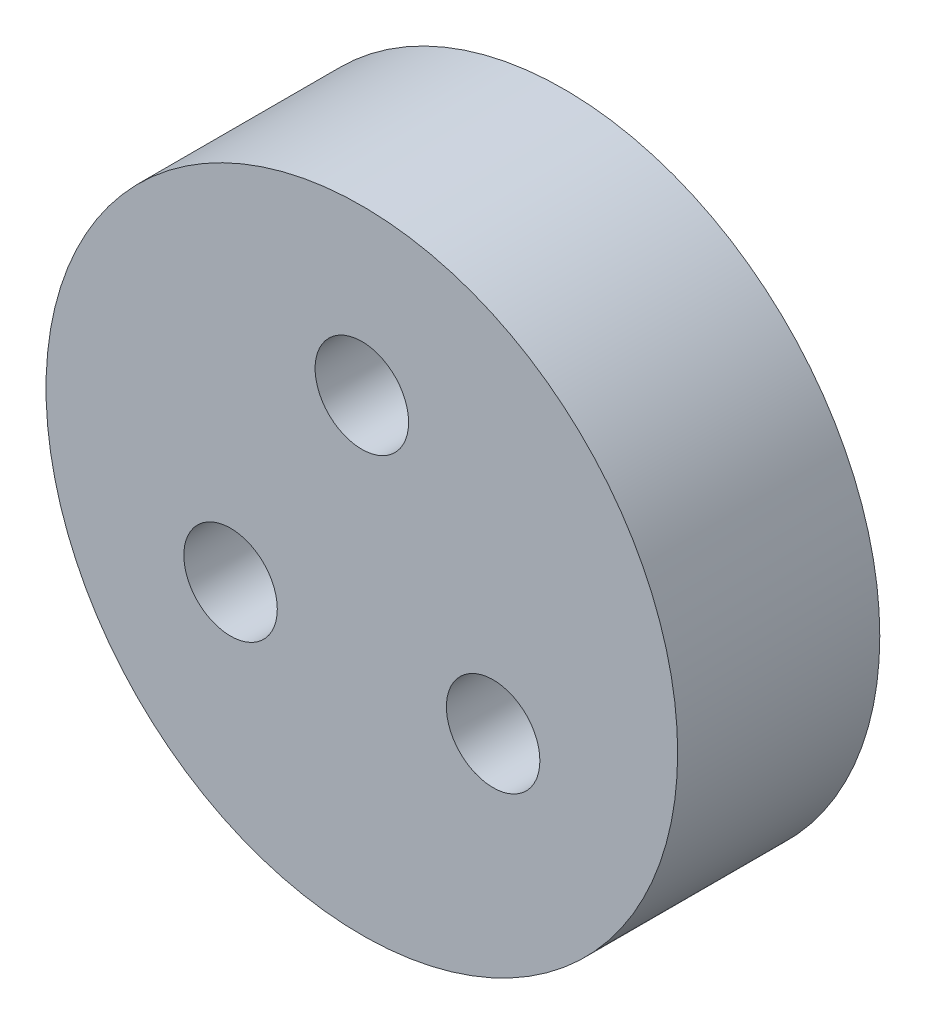
ISO-10303-21;
HEADER;
FILE_DESCRIPTION(('STEP AP214'),'2;1');
FILE_NAME('part.step','',(''),(''),'','','');
FILE_SCHEMA(('AUTOMOTIVE_DESIGN { 1 0 10303 214 1 1 1 1 }'));
ENDSEC;
DATA;
#1=APPLICATION_CONTEXT('core data for automotive mechanical design processes');
#2=APPLICATION_PROTOCOL_DEFINITION('international standard','automotive_design',2000,#1);
#3=PRODUCT_CONTEXT('',#1,'mechanical');
#4=PRODUCT('Part','Part','',(#3));
#5=PRODUCT_RELATED_PRODUCT_CATEGORY('part','',(#4));
#6=PRODUCT_DEFINITION_FORMATION('','',#4);
#7=PRODUCT_DEFINITION_CONTEXT('part definition',#1,'design');
#8=PRODUCT_DEFINITION('design','',#6,#7);
#9=PRODUCT_DEFINITION_SHAPE('','',#8);
#10=(LENGTH_UNIT() NAMED_UNIT(*) SI_UNIT(.MILLI.,.METRE.));
#11=(NAMED_UNIT(*) PLANE_ANGLE_UNIT() SI_UNIT($,.RADIAN.));
#12=(NAMED_UNIT(*) SI_UNIT($,.STERADIAN.) SOLID_ANGLE_UNIT());
#13=UNCERTAINTY_MEASURE_WITH_UNIT(LENGTH_MEASURE(1.E-05),#10,'distance_accuracy_value','');
#14=(GEOMETRIC_REPRESENTATION_CONTEXT(3) GLOBAL_UNCERTAINTY_ASSIGNED_CONTEXT((#13)) GLOBAL_UNIT_ASSIGNED_CONTEXT((#10,
#11,#12)) REPRESENTATION_CONTEXT('',''));
#15=CARTESIAN_POINT('',(0.,0.,0.));
#16=DIRECTION('',(0.,0.,1.));
#17=DIRECTION('',(1.,0.,0.));
#18=AXIS2_PLACEMENT_3D('',#15,#16,#17);
#19=CARTESIAN_POINT('',(-5.19615242270666,-2.99999999999995,-0.000999999999999265));
#20=DIRECTION('',(0.,0.,1.));
#21=DIRECTION('',(1.,0.,0.));
#22=AXIS2_PLACEMENT_3D('',#19,#20,#21);
#23=CYLINDRICAL_SURFACE('',#22,1.85);
#24=CARTESIAN_POINT('',(-5.19615242270666,-2.99999999999995,8.));
#25=DIRECTION('',(0.,0.,1.));
#26=DIRECTION('',(-0.499999999999992,0.866025403784443,0.));
#27=AXIS2_PLACEMENT_3D('',#24,#25,#26);
#28=CIRCLE('',#27,1.85);
#29=CARTESIAN_POINT('',(-6.12115242270664,-1.39785300299873,8.));
#30=VERTEX_POINT('',#29);
#31=EDGE_CURVE('E320',#30,#30,#28,.T.);
#32=ORIENTED_EDGE('',*,*,#31,.T.);
#33=EDGE_LOOP('',(#32));
#34=FACE_BOUND('',#33,.T.);
#35=CARTESIAN_POINT('',(-5.19615242270666,-2.99999999999995,5.));
#36=DIRECTION('',(0.,0.,-1.));
#37=DIRECTION('',(-1.,0.,0.));
#38=AXIS2_PLACEMENT_3D('',#35,#36,#37);
#39=CIRCLE('',#38,1.85);
#40=CARTESIAN_POINT('',(-7.04615242270666,-2.99999999999995,5.));
#41=VERTEX_POINT('',#40);
#42=EDGE_CURVE('E51',#41,#41,#39,.F.);
#43=ORIENTED_EDGE('',*,*,#42,.F.);
#44=EDGE_LOOP('',(#43));
#45=FACE_BOUND('',#44,.T.);
#46=ADVANCED_FACE('F47',(#34,#45),#23,.F.);
#47=CARTESIAN_POINT('',(5.19615242270662,-3.00000000000002,-0.000999999999999265));
#48=DIRECTION('',(0.,0.,1.));
#49=DIRECTION('',(1.,0.,0.));
#50=AXIS2_PLACEMENT_3D('',#47,#48,#49);
#51=CYLINDRICAL_SURFACE('',#50,1.85);
#52=CARTESIAN_POINT('',(5.19615242270662,-3.00000000000002,8.));
#53=DIRECTION('',(0.,0.,1.));
#54=DIRECTION('',(-0.500000000000004,-0.866025403784436,0.));
#55=AXIS2_PLACEMENT_3D('',#52,#53,#54);
#56=CIRCLE('',#55,1.85);
#57=CARTESIAN_POINT('',(4.27115242270661,-4.60214699700123,8.));
#58=VERTEX_POINT('',#57);
#59=EDGE_CURVE('E315',#58,#58,#56,.T.);
#60=ORIENTED_EDGE('',*,*,#59,.T.);
#61=EDGE_LOOP('',(#60));
#62=FACE_BOUND('',#61,.T.);
#63=CARTESIAN_POINT('',(5.19615242270662,-3.00000000000002,5.));
#64=DIRECTION('',(0.,0.,-1.));
#65=DIRECTION('',(-1.,0.,0.));
#66=AXIS2_PLACEMENT_3D('',#63,#64,#65);
#67=CIRCLE('',#66,1.85);
#68=CARTESIAN_POINT('',(3.34615242270662,-3.00000000000002,5.));
#69=VERTEX_POINT('',#68);
#70=EDGE_CURVE('E240',#69,#69,#67,.F.);
#71=ORIENTED_EDGE('',*,*,#70,.F.);
#72=EDGE_LOOP('',(#71));
#73=FACE_BOUND('',#72,.T.);
#74=ADVANCED_FACE('F407',(#62,#73),#51,.F.);
#75=CARTESIAN_POINT('',(0.,6.,-0.000999999999999265));
#76=DIRECTION('',(0.,0.,1.));
#77=DIRECTION('',(1.,0.,0.));
#78=AXIS2_PLACEMENT_3D('',#75,#76,#77);
#79=CYLINDRICAL_SURFACE('',#78,1.85);
#80=CARTESIAN_POINT('',(0.,6.,8.));
#81=DIRECTION('',(0.,0.,1.));
#82=DIRECTION('',(1.,0.,0.));
#83=AXIS2_PLACEMENT_3D('',#80,#81,#82);
#84=CIRCLE('',#83,1.85);
#85=CARTESIAN_POINT('',(1.85,6.,8.));
#86=VERTEX_POINT('',#85);
#87=EDGE_CURVE('E389',#86,#86,#84,.T.);
#88=ORIENTED_EDGE('',*,*,#87,.T.);
#89=EDGE_LOOP('',(#88));
#90=FACE_BOUND('',#89,.T.);
#91=CARTESIAN_POINT('',(0.,6.,5.));
#92=DIRECTION('',(0.,0.,-1.));
#93=DIRECTION('',(-1.,0.,0.));
#94=AXIS2_PLACEMENT_3D('',#91,#92,#93);
#95=CIRCLE('',#94,1.85);
#96=CARTESIAN_POINT('',(-1.85,6.,5.));
#97=VERTEX_POINT('',#96);
#98=EDGE_CURVE('E373',#97,#97,#95,.F.);
#99=ORIENTED_EDGE('',*,*,#98,.F.);
#100=EDGE_LOOP('',(#99));
#101=FACE_BOUND('',#100,.T.);
#102=ADVANCED_FACE('F413',(#90,#101),#79,.F.);
#103=CARTESIAN_POINT('',(0.,0.,8.));
#104=DIRECTION('',(0.,0.,-1.));
#105=DIRECTION('',(-1.,0.,0.));
#106=AXIS2_PLACEMENT_3D('',#103,#104,#105);
#107=CYLINDRICAL_SURFACE('',#106,12.5);
#108=CARTESIAN_POINT('',(0.,0.,8.));
#109=DIRECTION('',(0.,0.,1.));
#110=DIRECTION('',(1.,0.,0.));
#111=AXIS2_PLACEMENT_3D('',#108,#109,#110);
#112=CIRCLE('',#111,12.5);
#113=CARTESIAN_POINT('',(12.5,0.,8.));
#114=VERTEX_POINT('',#113);
#115=EDGE_CURVE('E11',#114,#114,#112,.T.);
#116=ORIENTED_EDGE('',*,*,#115,.F.);
#117=EDGE_LOOP('',(#116));
#118=FACE_BOUND('',#117,.T.);
#119=CARTESIAN_POINT('',(0.,0.,0.));
#120=DIRECTION('',(0.,0.,1.));
#121=DIRECTION('',(1.,0.,0.));
#122=AXIS2_PLACEMENT_3D('',#119,#120,#121);
#123=CIRCLE('',#122,12.5);
#124=CARTESIAN_POINT('',(12.5,0.,0.));
#125=VERTEX_POINT('',#124);
#126=EDGE_CURVE('E57',#125,#125,#123,.T.);
#127=ORIENTED_EDGE('',*,*,#126,.T.);
#128=EDGE_LOOP('',(#127));
#129=FACE_BOUND('',#128,.T.);
#130=ADVANCED_FACE('F49',(#118,#129),#107,.T.);
#131=CARTESIAN_POINT('',(0.,0.,8.));
#132=DIRECTION('',(0.,0.,1.));
#133=DIRECTION('',(1.,0.,0.));
#134=AXIS2_PLACEMENT_3D('',#131,#132,#133);
#135=PLANE('',#134);
#136=ORIENTED_EDGE('',*,*,#59,.F.);
#137=EDGE_LOOP('',(#136));
#138=FACE_BOUND('',#137,.T.);
#139=ORIENTED_EDGE('',*,*,#31,.F.);
#140=EDGE_LOOP('',(#139));
#141=FACE_BOUND('',#140,.T.);
#142=ORIENTED_EDGE('',*,*,#87,.F.);
#143=EDGE_LOOP('',(#142));
#144=FACE_BOUND('',#143,.T.);
#145=ORIENTED_EDGE('',*,*,#115,.T.);
#146=EDGE_LOOP('',(#145));
#147=FACE_BOUND('',#146,.T.);
#148=ADVANCED_FACE('F450',(#138,#141,#144,#147),#135,.T.);
#149=CARTESIAN_POINT('',(0.,0.,0.));
#150=DIRECTION('',(0.,0.,1.));
#151=DIRECTION('',(1.,0.,0.));
#152=AXIS2_PLACEMENT_3D('',#149,#150,#151);
#153=PLANE('',#152);
#154=DIRECTION('',(0.499999999999996,-0.866025403784441,0.));
#155=VECTOR('',#154,1.);
#156=CARTESIAN_POINT('',(6.81273317643758,-0.200000000000031,0.));
#157=LINE('',#156,#155);
#158=CARTESIAN_POINT('',(6.81273317643758,-0.200000000000031,0.));
#159=VERTEX_POINT('',#158);
#160=CARTESIAN_POINT('',(8.42931393016853,-3.00000000000004,0.));
#161=VERTEX_POINT('',#160);
#162=EDGE_CURVE('E222',#159,#161,#157,.T.);
#163=ORIENTED_EDGE('',*,*,#162,.F.);
#164=DIRECTION('',(1.,0.,0.));
#165=VECTOR('',#164,1.);
#166=CARTESIAN_POINT('',(3.57957166897568,-0.200000000000015,0.));
#167=LINE('',#166,#165);
#168=CARTESIAN_POINT('',(3.57957166897568,-0.200000000000015,0.));
#169=VERTEX_POINT('',#168);
#170=EDGE_CURVE('E65',#169,#159,#167,.T.);
#171=ORIENTED_EDGE('',*,*,#170,.F.);
#172=DIRECTION('',(0.500000000000004,0.866025403784437,0.));
#173=VECTOR('',#172,1.);
#174=CARTESIAN_POINT('',(1.96299091524471,-3.00000000000001,0.));
#175=LINE('',#174,#173);
#176=CARTESIAN_POINT('',(1.96299091524471,-3.00000000000001,0.));
#177=VERTEX_POINT('',#176);
#178=EDGE_CURVE('E200',#177,#169,#175,.T.);
#179=ORIENTED_EDGE('',*,*,#178,.F.);
#180=DIRECTION('',(-0.499999999999996,0.866025403784441,0.));
#181=VECTOR('',#180,1.);
#182=CARTESIAN_POINT('',(3.57957166897565,-5.80000000000002,0.));
#183=LINE('',#182,#181);
#184=CARTESIAN_POINT('',(3.57957166897565,-5.80000000000002,0.));
#185=VERTEX_POINT('',#184);
#186=EDGE_CURVE('E206',#185,#177,#183,.T.);
#187=ORIENTED_EDGE('',*,*,#186,.F.);
#188=DIRECTION('',(-1.,0.,0.));
#189=VECTOR('',#188,1.);
#190=CARTESIAN_POINT('',(6.81273317643756,-5.80000000000003,0.));
#191=LINE('',#190,#189);
#192=CARTESIAN_POINT('',(6.81273317643756,-5.80000000000003,0.));
#193=VERTEX_POINT('',#192);
#194=EDGE_CURVE('E230',#193,#185,#191,.T.);
#195=ORIENTED_EDGE('',*,*,#194,.F.);
#196=DIRECTION('',(-0.500000000000004,-0.866025403784436,0.));
#197=VECTOR('',#196,1.);
#198=CARTESIAN_POINT('',(8.42931393016853,-3.00000000000004,0.));
#199=LINE('',#198,#197);
#200=EDGE_CURVE('E226',#161,#193,#199,.T.);
#201=ORIENTED_EDGE('',*,*,#200,.F.);
#202=EDGE_LOOP('',(#163,#171,#179,#187,#195,#201));
#203=FACE_BOUND('',#202,.T.);
#204=DIRECTION('',(-1.,0.,0.));
#205=VECTOR('',#204,1.);
#206=CARTESIAN_POINT('',(-3.57957166897573,-5.79999999999997,0.));
#207=LINE('',#206,#205);
#208=CARTESIAN_POINT('',(-3.57957166897573,-5.79999999999997,0.));
#209=VERTEX_POINT('',#208);
#210=CARTESIAN_POINT('',(-6.81273317643764,-5.79999999999994,0.));
#211=VERTEX_POINT('',#210);
#212=EDGE_CURVE('E280',#209,#211,#207,.T.);
#213=ORIENTED_EDGE('',*,*,#212,.F.);
#214=DIRECTION('',(-0.500000000000008,-0.866025403784434,0.));
#215=VECTOR('',#214,1.);
#216=CARTESIAN_POINT('',(-1.96299091524475,-2.99999999999998,0.));
#217=LINE('',#216,#215);
#218=CARTESIAN_POINT('',(-1.96299091524475,-2.99999999999998,0.));
#219=VERTEX_POINT('',#218);
#220=EDGE_CURVE('E73',#219,#209,#217,.T.);
#221=ORIENTED_EDGE('',*,*,#220,.F.);
#222=DIRECTION('',(0.499999999999992,-0.866025403784443,0.));
#223=VECTOR('',#222,1.);
#224=CARTESIAN_POINT('',(-3.57957166897568,-0.199999999999965,0.));
#225=LINE('',#224,#223);
#226=CARTESIAN_POINT('',(-3.57957166897568,-0.199999999999965,0.));
#227=VERTEX_POINT('',#226);
#228=EDGE_CURVE('E257',#227,#219,#225,.T.);
#229=ORIENTED_EDGE('',*,*,#228,.F.);
#230=DIRECTION('',(1.,0.,0.));
#231=VECTOR('',#230,1.);
#232=CARTESIAN_POINT('',(-6.81273317643759,-0.199999999999935,0.));
#233=LINE('',#232,#231);
#234=CARTESIAN_POINT('',(-6.81273317643759,-0.199999999999935,0.));
#235=VERTEX_POINT('',#234);
#236=EDGE_CURVE('E292',#235,#227,#233,.T.);
#237=ORIENTED_EDGE('',*,*,#236,.F.);
#238=DIRECTION('',(0.500000000000008,0.866025403784434,0.));
#239=VECTOR('',#238,1.);
#240=CARTESIAN_POINT('',(-8.42931393016857,-2.99999999999992,0.));
#241=LINE('',#240,#239);
#242=CARTESIAN_POINT('',(-8.42931393016857,-2.99999999999992,0.));
#243=VERTEX_POINT('',#242);
#244=EDGE_CURVE('E288',#243,#235,#241,.T.);
#245=ORIENTED_EDGE('',*,*,#244,.F.);
#246=DIRECTION('',(-0.499999999999992,0.866025403784443,0.));
#247=VECTOR('',#246,1.);
#248=CARTESIAN_POINT('',(-6.81273317643764,-5.79999999999994,0.));
#249=LINE('',#248,#247);
#250=EDGE_CURVE('E284',#211,#243,#249,.T.);
#251=ORIENTED_EDGE('',*,*,#250,.F.);
#252=EDGE_LOOP('',(#213,#221,#229,#237,#245,#251));
#253=FACE_BOUND('',#252,.T.);
#254=DIRECTION('',(0.5,0.866025403784439,0.));
#255=VECTOR('',#254,1.);
#256=CARTESIAN_POINT('',(-3.2331615074619,6.,0.));
#257=LINE('',#256,#255);
#258=CARTESIAN_POINT('',(-3.2331615074619,6.,0.));
#259=VERTEX_POINT('',#258);
#260=CARTESIAN_POINT('',(-1.61658075373095,8.8,0.));
#261=VERTEX_POINT('',#260);
#262=EDGE_CURVE('E352',#259,#261,#257,.T.);
#263=ORIENTED_EDGE('',*,*,#262,.F.);
#264=DIRECTION('',(-0.5,0.866025403784439,0.));
#265=VECTOR('',#264,1.);
#266=CARTESIAN_POINT('',(-1.61658075373095,3.2,0.));
#267=LINE('',#266,#265);
#268=CARTESIAN_POINT('',(-1.61658075373095,3.2,0.));
#269=VERTEX_POINT('',#268);
#270=EDGE_CURVE('E319',#269,#259,#267,.T.);
#271=ORIENTED_EDGE('',*,*,#270,.F.);
#272=DIRECTION('',(-1.,0.,0.));
#273=VECTOR('',#272,1.);
#274=CARTESIAN_POINT('',(1.61658075373095,3.2,0.));
#275=LINE('',#274,#273);
#276=CARTESIAN_POINT('',(1.61658075373095,3.2,0.));
#277=VERTEX_POINT('',#276);
#278=EDGE_CURVE('E329',#277,#269,#275,.T.);
#279=ORIENTED_EDGE('',*,*,#278,.F.);
#280=DIRECTION('',(-0.5,-0.866025403784439,0.));
#281=VECTOR('',#280,1.);
#282=CARTESIAN_POINT('',(3.23316150746191,6.,0.));
#283=LINE('',#282,#281);
#284=CARTESIAN_POINT('',(3.23316150746191,6.,0.));
#285=VERTEX_POINT('',#284);
#286=EDGE_CURVE('E364',#285,#277,#283,.T.);
#287=ORIENTED_EDGE('',*,*,#286,.F.);
#288=DIRECTION('',(0.5,-0.866025403784438,0.));
#289=VECTOR('',#288,1.);
#290=CARTESIAN_POINT('',(1.61658075373095,8.8,0.));
#291=LINE('',#290,#289);
#292=CARTESIAN_POINT('',(1.61658075373095,8.8,0.));
#293=VERTEX_POINT('',#292);
#294=EDGE_CURVE('E360',#293,#285,#291,.T.);
#295=ORIENTED_EDGE('',*,*,#294,.F.);
#296=DIRECTION('',(1.,0.,0.));
#297=VECTOR('',#296,1.);
#298=CARTESIAN_POINT('',(-1.61658075373095,8.8,0.));
#299=LINE('',#298,#297);
#300=EDGE_CURVE('E356',#261,#293,#299,.T.);
#301=ORIENTED_EDGE('',*,*,#300,.F.);
#302=EDGE_LOOP('',(#263,#271,#279,#287,#295,#301));
#303=FACE_BOUND('',#302,.T.);
#304=ORIENTED_EDGE('',*,*,#126,.F.);
#305=EDGE_LOOP('',(#304));
#306=FACE_BOUND('',#305,.T.);
#307=ADVANCED_FACE('F422',(#203,#253,#303,#306),#153,.F.);
#308=CARTESIAN_POINT('',(0.,0.,5.));
#309=DIRECTION('',(0.,0.,-1.));
#310=DIRECTION('',(-1.,0.,0.));
#311=AXIS2_PLACEMENT_3D('',#308,#309,#310);
#312=PLANE('',#311);
#313=DIRECTION('',(-0.5,0.866025403784439,0.));
#314=VECTOR('',#313,1.);
#315=CARTESIAN_POINT('',(-1.61658075373095,3.2,5.));
#316=LINE('',#315,#314);
#317=CARTESIAN_POINT('',(-1.61658075373095,3.2,5.));
#318=VERTEX_POINT('',#317);
#319=CARTESIAN_POINT('',(-3.2331615074619,6.,5.));
#320=VERTEX_POINT('',#319);
#321=EDGE_CURVE('E324',#318,#320,#316,.T.);
#322=ORIENTED_EDGE('',*,*,#321,.T.);
#323=DIRECTION('',(0.5,0.866025403784439,0.));
#324=VECTOR('',#323,1.);
#325=CARTESIAN_POINT('',(-3.2331615074619,6.,5.));
#326=LINE('',#325,#324);
#327=CARTESIAN_POINT('',(-1.61658075373095,8.8,5.));
#328=VERTEX_POINT('',#327);
#329=EDGE_CURVE('E328',#320,#328,#326,.T.);
#330=ORIENTED_EDGE('',*,*,#329,.T.);
#331=DIRECTION('',(1.,0.,0.));
#332=VECTOR('',#331,1.);
#333=CARTESIAN_POINT('',(-1.61658075373095,8.8,5.));
#334=LINE('',#333,#332);
#335=CARTESIAN_POINT('',(1.61658075373095,8.8,5.));
#336=VERTEX_POINT('',#335);
#337=EDGE_CURVE('E333',#328,#336,#334,.T.);
#338=ORIENTED_EDGE('',*,*,#337,.T.);
#339=DIRECTION('',(0.5,-0.866025403784438,0.));
#340=VECTOR('',#339,1.);
#341=CARTESIAN_POINT('',(1.61658075373095,8.8,5.));
#342=LINE('',#341,#340);
#343=CARTESIAN_POINT('',(3.23316150746191,6.,5.));
#344=VERTEX_POINT('',#343);
#345=EDGE_CURVE('E337',#336,#344,#342,.T.);
#346=ORIENTED_EDGE('',*,*,#345,.T.);
#347=DIRECTION('',(-0.5,-0.866025403784439,0.));
#348=VECTOR('',#347,1.);
#349=CARTESIAN_POINT('',(3.23316150746191,6.,5.));
#350=LINE('',#349,#348);
#351=CARTESIAN_POINT('',(1.61658075373095,3.2,5.));
#352=VERTEX_POINT('',#351);
#353=EDGE_CURVE('E341',#344,#352,#350,.T.);
#354=ORIENTED_EDGE('',*,*,#353,.T.);
#355=DIRECTION('',(-1.,0.,0.));
#356=VECTOR('',#355,1.);
#357=CARTESIAN_POINT('',(1.61658075373095,3.2,5.));
#358=LINE('',#357,#356);
#359=EDGE_CURVE('E345',#352,#318,#358,.T.);
#360=ORIENTED_EDGE('',*,*,#359,.T.);
#361=EDGE_LOOP('',(#322,#330,#338,#346,#354,#360));
#362=FACE_BOUND('',#361,.T.);
#363=ORIENTED_EDGE('',*,*,#98,.T.);
#364=EDGE_LOOP('',(#363));
#365=FACE_BOUND('',#364,.T.);
#366=ADVANCED_FACE('F418',(#362,#365),#312,.T.);
#367=CARTESIAN_POINT('',(-1.61658075373095,3.2,5.));
#368=DIRECTION('',(-0.866025403784439,-0.5,0.));
#369=DIRECTION('',(0.5,-0.866025403784439,0.));
#370=AXIS2_PLACEMENT_3D('',#367,#368,#369);
#371=PLANE('',#370);
#372=ORIENTED_EDGE('',*,*,#270,.T.);
#373=DIRECTION('',(0.,0.,-1.));
#374=VECTOR('',#373,1.);
#375=CARTESIAN_POINT('',(-3.2331615074619,6.,5.));
#376=LINE('',#375,#374);
#377=EDGE_CURVE('E349',#320,#259,#376,.T.);
#378=ORIENTED_EDGE('',*,*,#377,.F.);
#379=ORIENTED_EDGE('',*,*,#321,.F.);
#380=DIRECTION('',(0.,0.,-1.));
#381=VECTOR('',#380,1.);
#382=CARTESIAN_POINT('',(-1.61658075373095,3.2,5.));
#383=LINE('',#382,#381);
#384=EDGE_CURVE('E371',#318,#269,#383,.T.);
#385=ORIENTED_EDGE('',*,*,#384,.T.);
#386=EDGE_LOOP('',(#372,#378,#379,#385));
#387=FACE_BOUND('',#386,.T.);
#388=ADVANCED_FACE('F421',(#387),#371,.F.);
#389=CARTESIAN_POINT('',(1.61658075373095,3.2,5.));
#390=DIRECTION('',(0.,-1.,0.));
#391=DIRECTION('',(1.,0.,0.));
#392=AXIS2_PLACEMENT_3D('',#389,#390,#391);
#393=PLANE('',#392);
#394=ORIENTED_EDGE('',*,*,#278,.T.);
#395=ORIENTED_EDGE('',*,*,#384,.F.);
#396=ORIENTED_EDGE('',*,*,#359,.F.);
#397=DIRECTION('',(0.,0.,-1.));
#398=VECTOR('',#397,1.);
#399=CARTESIAN_POINT('',(1.61658075373095,3.2,5.));
#400=LINE('',#399,#398);
#401=EDGE_CURVE('E374',#352,#277,#400,.T.);
#402=ORIENTED_EDGE('',*,*,#401,.T.);
#403=EDGE_LOOP('',(#394,#395,#396,#402));
#404=FACE_BOUND('',#403,.T.);
#405=ADVANCED_FACE('F424',(#404),#393,.F.);
#406=CARTESIAN_POINT('',(3.23316150746191,6.,5.));
#407=DIRECTION('',(0.866025403784439,-0.5,0.));
#408=DIRECTION('',(0.5,0.866025403784439,0.));
#409=AXIS2_PLACEMENT_3D('',#406,#407,#408);
#410=PLANE('',#409);
#411=ORIENTED_EDGE('',*,*,#286,.T.);
#412=ORIENTED_EDGE('',*,*,#401,.F.);
#413=ORIENTED_EDGE('',*,*,#353,.F.);
#414=DIRECTION('',(0.,0.,-1.));
#415=VECTOR('',#414,1.);
#416=CARTESIAN_POINT('',(3.23316150746191,6.,5.));
#417=LINE('',#416,#415);
#418=EDGE_CURVE('E377',#344,#285,#417,.T.);
#419=ORIENTED_EDGE('',*,*,#418,.T.);
#420=EDGE_LOOP('',(#411,#412,#413,#419));
#421=FACE_BOUND('',#420,.T.);
#422=ADVANCED_FACE('F427',(#421),#410,.F.);
#423=CARTESIAN_POINT('',(1.61658075373095,8.8,5.));
#424=DIRECTION('',(0.866025403784439,0.5,0.));
#425=DIRECTION('',(-0.5,0.866025403784439,0.));
#426=AXIS2_PLACEMENT_3D('',#423,#424,#425);
#427=PLANE('',#426);
#428=ORIENTED_EDGE('',*,*,#294,.T.);
#429=ORIENTED_EDGE('',*,*,#418,.F.);
#430=ORIENTED_EDGE('',*,*,#345,.F.);
#431=DIRECTION('',(0.,0.,-1.));
#432=VECTOR('',#431,1.);
#433=CARTESIAN_POINT('',(1.61658075373095,8.8,5.));
#434=LINE('',#433,#432);
#435=EDGE_CURVE('E380',#336,#293,#434,.T.);
#436=ORIENTED_EDGE('',*,*,#435,.T.);
#437=EDGE_LOOP('',(#428,#429,#430,#436));
#438=FACE_BOUND('',#437,.T.);
#439=ADVANCED_FACE('F431',(#438),#427,.F.);
#440=CARTESIAN_POINT('',(-1.61658075373095,8.8,5.));
#441=DIRECTION('',(0.,1.,0.));
#442=DIRECTION('',(0.,0.,1.));
#443=AXIS2_PLACEMENT_3D('',#440,#441,#442);
#444=PLANE('',#443);
#445=ORIENTED_EDGE('',*,*,#300,.T.);
#446=ORIENTED_EDGE('',*,*,#435,.F.);
#447=ORIENTED_EDGE('',*,*,#337,.F.);
#448=DIRECTION('',(0.,0.,-1.));
#449=VECTOR('',#448,1.);
#450=CARTESIAN_POINT('',(-1.61658075373095,8.8,5.));
#451=LINE('',#450,#449);
#452=EDGE_CURVE('E383',#328,#261,#451,.T.);
#453=ORIENTED_EDGE('',*,*,#452,.T.);
#454=EDGE_LOOP('',(#445,#446,#447,#453));
#455=FACE_BOUND('',#454,.T.);
#456=ADVANCED_FACE('F435',(#455),#444,.F.);
#457=CARTESIAN_POINT('',(-3.2331615074619,6.,5.));
#458=DIRECTION('',(-0.866025403784439,0.5,0.));
#459=DIRECTION('',(-0.5,-0.866025403784439,0.));
#460=AXIS2_PLACEMENT_3D('',#457,#458,#459);
#461=PLANE('',#460);
#462=ORIENTED_EDGE('',*,*,#262,.T.);
#463=ORIENTED_EDGE('',*,*,#452,.F.);
#464=ORIENTED_EDGE('',*,*,#329,.F.);
#465=ORIENTED_EDGE('',*,*,#377,.T.);
#466=EDGE_LOOP('',(#462,#463,#464,#465));
#467=FACE_BOUND('',#466,.T.);
#468=ADVANCED_FACE('F439',(#467),#461,.F.);
#469=CARTESIAN_POINT('',(0.,0.,5.));
#470=DIRECTION('',(0.,0.,-1.));
#471=DIRECTION('',(0.500000000000004,0.866025403784436,0.));
#472=AXIS2_PLACEMENT_3D('',#469,#470,#471);
#473=PLANE('',#472);
#474=DIRECTION('',(1.,0.,0.));
#475=VECTOR('',#474,1.);
#476=CARTESIAN_POINT('',(3.57957166897568,-0.200000000000015,5.));
#477=LINE('',#476,#475);
#478=CARTESIAN_POINT('',(3.57957166897568,-0.200000000000015,5.));
#479=VERTEX_POINT('',#478);
#480=CARTESIAN_POINT('',(6.81273317643758,-0.200000000000031,5.));
#481=VERTEX_POINT('',#480);
#482=EDGE_CURVE('E177',#479,#481,#477,.T.);
#483=ORIENTED_EDGE('',*,*,#482,.T.);
#484=DIRECTION('',(0.499999999999996,-0.866025403784441,0.));
#485=VECTOR('',#484,1.);
#486=CARTESIAN_POINT('',(6.81273317643758,-0.200000000000031,5.));
#487=LINE('',#486,#485);
#488=CARTESIAN_POINT('',(8.42931393016853,-3.00000000000004,5.));
#489=VERTEX_POINT('',#488);
#490=EDGE_CURVE('E187',#481,#489,#487,.T.);
#491=ORIENTED_EDGE('',*,*,#490,.T.);
#492=DIRECTION('',(-0.500000000000004,-0.866025403784436,0.));
#493=VECTOR('',#492,1.);
#494=CARTESIAN_POINT('',(8.42931393016853,-3.00000000000004,5.));
#495=LINE('',#494,#493);
#496=CARTESIAN_POINT('',(6.81273317643756,-5.80000000000003,5.));
#497=VERTEX_POINT('',#496);
#498=EDGE_CURVE('E193',#489,#497,#495,.T.);
#499=ORIENTED_EDGE('',*,*,#498,.T.);
#500=DIRECTION('',(-1.,0.,0.));
#501=VECTOR('',#500,1.);
#502=CARTESIAN_POINT('',(6.81273317643756,-5.80000000000003,5.));
#503=LINE('',#502,#501);
#504=CARTESIAN_POINT('',(3.57957166897565,-5.80000000000002,5.));
#505=VERTEX_POINT('',#504);
#506=EDGE_CURVE('E211',#497,#505,#503,.T.);
#507=ORIENTED_EDGE('',*,*,#506,.T.);
#508=DIRECTION('',(-0.499999999999996,0.866025403784441,0.));
#509=VECTOR('',#508,1.);
#510=CARTESIAN_POINT('',(3.57957166897565,-5.80000000000002,5.));
#511=LINE('',#510,#509);
#512=CARTESIAN_POINT('',(1.96299091524471,-3.00000000000001,5.));
#513=VERTEX_POINT('',#512);
#514=EDGE_CURVE('E215',#505,#513,#511,.T.);
#515=ORIENTED_EDGE('',*,*,#514,.T.);
#516=DIRECTION('',(0.500000000000004,0.866025403784437,0.));
#517=VECTOR('',#516,1.);
#518=CARTESIAN_POINT('',(1.96299091524471,-3.00000000000001,5.));
#519=LINE('',#518,#517);
#520=EDGE_CURVE('E184',#513,#479,#519,.T.);
#521=ORIENTED_EDGE('',*,*,#520,.T.);
#522=EDGE_LOOP('',(#483,#491,#499,#507,#515,#521));
#523=FACE_BOUND('',#522,.T.);
#524=ORIENTED_EDGE('',*,*,#70,.T.);
#525=EDGE_LOOP('',(#524));
#526=FACE_BOUND('',#525,.T.);
#527=ADVANCED_FACE('F195',(#523,#526),#473,.T.);
#528=CARTESIAN_POINT('',(3.57957166897568,-0.200000000000015,5.));
#529=DIRECTION('',(0.,1.,0.));
#530=DIRECTION('',(-1.,0.,0.));
#531=AXIS2_PLACEMENT_3D('',#528,#529,#530);
#532=PLANE('',#531);
#533=ORIENTED_EDGE('',*,*,#170,.T.);
#534=DIRECTION('',(0.,0.,-1.));
#535=VECTOR('',#534,1.);
#536=CARTESIAN_POINT('',(6.81273317643758,-0.200000000000031,5.));
#537=LINE('',#536,#535);
#538=EDGE_CURVE('E173',#481,#159,#537,.T.);
#539=ORIENTED_EDGE('',*,*,#538,.F.);
#540=ORIENTED_EDGE('',*,*,#482,.F.);
#541=DIRECTION('',(0.,0.,-1.));
#542=VECTOR('',#541,1.);
#543=CARTESIAN_POINT('',(3.57957166897568,-0.200000000000015,5.));
#544=LINE('',#543,#542);
#545=EDGE_CURVE('E237',#479,#169,#544,.T.);
#546=ORIENTED_EDGE('',*,*,#545,.T.);
#547=EDGE_LOOP('',(#533,#539,#540,#546));
#548=FACE_BOUND('',#547,.T.);
#549=ADVANCED_FACE('F175',(#548),#532,.F.);
#550=CARTESIAN_POINT('',(1.96299091524471,-3.00000000000001,5.));
#551=DIRECTION('',(-0.866025403784436,0.500000000000004,0.));
#552=DIRECTION('',(-0.500000000000004,-0.866025403784436,0.));
#553=AXIS2_PLACEMENT_3D('',#550,#551,#552);
#554=PLANE('',#553);
#555=ORIENTED_EDGE('',*,*,#178,.T.);
#556=ORIENTED_EDGE('',*,*,#545,.F.);
#557=ORIENTED_EDGE('',*,*,#520,.F.);
#558=DIRECTION('',(0.,0.,-1.));
#559=VECTOR('',#558,1.);
#560=CARTESIAN_POINT('',(1.96299091524471,-3.00000000000001,5.));
#561=LINE('',#560,#559);
#562=EDGE_CURVE('E241',#513,#177,#561,.T.);
#563=ORIENTED_EDGE('',*,*,#562,.T.);
#564=EDGE_LOOP('',(#555,#556,#557,#563));
#565=FACE_BOUND('',#564,.T.);
#566=ADVANCED_FACE('F534',(#565),#554,.F.);
#567=CARTESIAN_POINT('',(3.57957166897565,-5.80000000000002,5.));
#568=DIRECTION('',(-0.866025403784441,-0.499999999999996,0.));
#569=DIRECTION('',(0.499999999999996,-0.866025403784441,0.));
#570=AXIS2_PLACEMENT_3D('',#567,#568,#569);
#571=PLANE('',#570);
#572=ORIENTED_EDGE('',*,*,#186,.T.);
#573=ORIENTED_EDGE('',*,*,#562,.F.);
#574=ORIENTED_EDGE('',*,*,#514,.F.);
#575=DIRECTION('',(0.,0.,-1.));
#576=VECTOR('',#575,1.);
#577=CARTESIAN_POINT('',(3.57957166897565,-5.80000000000002,5.));
#578=LINE('',#577,#576);
#579=EDGE_CURVE('E244',#505,#185,#578,.T.);
#580=ORIENTED_EDGE('',*,*,#579,.T.);
#581=EDGE_LOOP('',(#572,#573,#574,#580));
#582=FACE_BOUND('',#581,.T.);
#583=ADVANCED_FACE('F542',(#582),#571,.F.);
#584=CARTESIAN_POINT('',(6.81273317643756,-5.80000000000003,5.));
#585=DIRECTION('',(0.,-1.,0.));
#586=DIRECTION('',(1.,0.,0.));
#587=AXIS2_PLACEMENT_3D('',#584,#585,#586);
#588=PLANE('',#587);
#589=ORIENTED_EDGE('',*,*,#194,.T.);
#590=ORIENTED_EDGE('',*,*,#579,.F.);
#591=ORIENTED_EDGE('',*,*,#506,.F.);
#592=DIRECTION('',(0.,0.,-1.));
#593=VECTOR('',#592,1.);
#594=CARTESIAN_POINT('',(6.81273317643756,-5.80000000000003,5.));
#595=LINE('',#594,#593);
#596=EDGE_CURVE('E247',#497,#193,#595,.T.);
#597=ORIENTED_EDGE('',*,*,#596,.T.);
#598=EDGE_LOOP('',(#589,#590,#591,#597));
#599=FACE_BOUND('',#598,.T.);
#600=ADVANCED_FACE('F551',(#599),#588,.F.);
#601=CARTESIAN_POINT('',(8.42931393016853,-3.00000000000004,5.));
#602=DIRECTION('',(0.866025403784436,-0.500000000000004,0.));
#603=DIRECTION('',(0.500000000000004,0.866025403784436,0.));
#604=AXIS2_PLACEMENT_3D('',#601,#602,#603);
#605=PLANE('',#604);
#606=ORIENTED_EDGE('',*,*,#200,.T.);
#607=ORIENTED_EDGE('',*,*,#596,.F.);
#608=ORIENTED_EDGE('',*,*,#498,.F.);
#609=DIRECTION('',(0.,0.,-1.));
#610=VECTOR('',#609,1.);
#611=CARTESIAN_POINT('',(8.42931393016853,-3.00000000000004,5.));
#612=LINE('',#611,#610);
#613=EDGE_CURVE('E183',#489,#161,#612,.T.);
#614=ORIENTED_EDGE('',*,*,#613,.T.);
#615=EDGE_LOOP('',(#606,#607,#608,#614));
#616=FACE_BOUND('',#615,.T.);
#617=ADVANCED_FACE('F560',(#616),#605,.F.);
#618=CARTESIAN_POINT('',(6.81273317643758,-0.200000000000031,5.));
#619=DIRECTION('',(0.866025403784441,0.499999999999996,0.));
#620=DIRECTION('',(-0.499999999999996,0.866025403784441,0.));
#621=AXIS2_PLACEMENT_3D('',#618,#619,#620);
#622=PLANE('',#621);
#623=ORIENTED_EDGE('',*,*,#162,.T.);
#624=ORIENTED_EDGE('',*,*,#613,.F.);
#625=ORIENTED_EDGE('',*,*,#490,.F.);
#626=ORIENTED_EDGE('',*,*,#538,.T.);
#627=EDGE_LOOP('',(#623,#624,#625,#626));
#628=FACE_BOUND('',#627,.T.);
#629=ADVANCED_FACE('F188',(#628),#622,.F.);
#630=CARTESIAN_POINT('',(0.,0.,5.));
#631=DIRECTION('',(0.,0.,-1.));
#632=DIRECTION('',(0.499999999999992,-0.866025403784443,0.));
#633=AXIS2_PLACEMENT_3D('',#630,#631,#632);
#634=PLANE('',#633);
#635=DIRECTION('',(-0.500000000000008,-0.866025403784434,0.));
#636=VECTOR('',#635,1.);
#637=CARTESIAN_POINT('',(-1.96299091524475,-2.99999999999998,5.));
#638=LINE('',#637,#636);
#639=CARTESIAN_POINT('',(-1.96299091524475,-2.99999999999998,5.));
#640=VERTEX_POINT('',#639);
#641=CARTESIAN_POINT('',(-3.57957166897573,-5.79999999999997,5.));
#642=VERTEX_POINT('',#641);
#643=EDGE_CURVE('E252',#640,#642,#638,.T.);
#644=ORIENTED_EDGE('',*,*,#643,.T.);
#645=DIRECTION('',(-1.,0.,0.));
#646=VECTOR('',#645,1.);
#647=CARTESIAN_POINT('',(-3.57957166897573,-5.79999999999997,5.));
#648=LINE('',#647,#646);
#649=CARTESIAN_POINT('',(-6.81273317643764,-5.79999999999994,5.));
#650=VERTEX_POINT('',#649);
#651=EDGE_CURVE('E256',#642,#650,#648,.T.);
#652=ORIENTED_EDGE('',*,*,#651,.T.);
#653=DIRECTION('',(-0.499999999999992,0.866025403784443,0.));
#654=VECTOR('',#653,1.);
#655=CARTESIAN_POINT('',(-6.81273317643764,-5.79999999999994,5.));
#656=LINE('',#655,#654);
#657=CARTESIAN_POINT('',(-8.42931393016857,-2.99999999999992,5.));
#658=VERTEX_POINT('',#657);
#659=EDGE_CURVE('E261',#650,#658,#656,.T.);
#660=ORIENTED_EDGE('',*,*,#659,.T.);
#661=DIRECTION('',(0.500000000000008,0.866025403784434,0.));
#662=VECTOR('',#661,1.);
#663=CARTESIAN_POINT('',(-8.42931393016857,-2.99999999999992,5.));
#664=LINE('',#663,#662);
#665=CARTESIAN_POINT('',(-6.81273317643759,-0.199999999999935,5.));
#666=VERTEX_POINT('',#665);
#667=EDGE_CURVE('E265',#658,#666,#664,.T.);
#668=ORIENTED_EDGE('',*,*,#667,.T.);
#669=DIRECTION('',(1.,0.,0.));
#670=VECTOR('',#669,1.);
#671=CARTESIAN_POINT('',(-6.81273317643759,-0.199999999999935,5.));
#672=LINE('',#671,#670);
#673=CARTESIAN_POINT('',(-3.57957166897568,-0.199999999999965,5.));
#674=VERTEX_POINT('',#673);
#675=EDGE_CURVE('E269',#666,#674,#672,.T.);
#676=ORIENTED_EDGE('',*,*,#675,.T.);
#677=DIRECTION('',(0.499999999999992,-0.866025403784443,0.));
#678=VECTOR('',#677,1.);
#679=CARTESIAN_POINT('',(-3.57957166897568,-0.199999999999965,5.));
#680=LINE('',#679,#678);
#681=EDGE_CURVE('E273',#674,#640,#680,.T.);
#682=ORIENTED_EDGE('',*,*,#681,.T.);
#683=EDGE_LOOP('',(#644,#652,#660,#668,#676,#682));
#684=FACE_BOUND('',#683,.T.);
#685=ORIENTED_EDGE('',*,*,#42,.T.);
#686=EDGE_LOOP('',(#685));
#687=FACE_BOUND('',#686,.T.);
#688=ADVANCED_FACE('F404',(#684,#687),#634,.T.);
#689=CARTESIAN_POINT('',(-1.96299091524475,-2.99999999999998,5.));
#690=DIRECTION('',(0.866025403784434,-0.500000000000008,0.));
#691=DIRECTION('',(0.500000000000008,0.866025403784434,0.));
#692=AXIS2_PLACEMENT_3D('',#689,#690,#691);
#693=PLANE('',#692);
#694=ORIENTED_EDGE('',*,*,#220,.T.);
#695=DIRECTION('',(0.,0.,-1.));
#696=VECTOR('',#695,1.);
#697=CARTESIAN_POINT('',(-3.57957166897573,-5.79999999999997,5.));
#698=LINE('',#697,#696);
#699=EDGE_CURVE('E277',#642,#209,#698,.T.);
#700=ORIENTED_EDGE('',*,*,#699,.F.);
#701=ORIENTED_EDGE('',*,*,#643,.F.);
#702=DIRECTION('',(0.,0.,-1.));
#703=VECTOR('',#702,1.);
#704=CARTESIAN_POINT('',(-1.96299091524475,-2.99999999999998,5.));
#705=LINE('',#704,#703);
#706=EDGE_CURVE('E223',#640,#219,#705,.T.);
#707=ORIENTED_EDGE('',*,*,#706,.T.);
#708=EDGE_LOOP('',(#694,#700,#701,#707));
#709=FACE_BOUND('',#708,.T.);
#710=ADVANCED_FACE('F584',(#709),#693,.F.);
#711=CARTESIAN_POINT('',(-3.57957166897568,-0.199999999999965,5.));
#712=DIRECTION('',(0.866025403784443,0.499999999999992,0.));
#713=DIRECTION('',(-0.499999999999992,0.866025403784443,0.));
#714=AXIS2_PLACEMENT_3D('',#711,#712,#713);
#715=PLANE('',#714);
#716=ORIENTED_EDGE('',*,*,#228,.T.);
#717=ORIENTED_EDGE('',*,*,#706,.F.);
#718=ORIENTED_EDGE('',*,*,#681,.F.);
#719=DIRECTION('',(0.,0.,-1.));
#720=VECTOR('',#719,1.);
#721=CARTESIAN_POINT('',(-3.57957166897568,-0.199999999999965,5.));
#722=LINE('',#721,#720);
#723=EDGE_CURVE('E301',#674,#227,#722,.T.);
#724=ORIENTED_EDGE('',*,*,#723,.T.);
#725=EDGE_LOOP('',(#716,#717,#718,#724));
#726=FACE_BOUND('',#725,.T.);
#727=ADVANCED_FACE('F593',(#726),#715,.F.);
#728=CARTESIAN_POINT('',(-6.81273317643759,-0.199999999999935,5.));
#729=DIRECTION('',(0.,1.,0.));
#730=DIRECTION('',(-1.,0.,0.));
#731=AXIS2_PLACEMENT_3D('',#728,#729,#730);
#732=PLANE('',#731);
#733=ORIENTED_EDGE('',*,*,#236,.T.);
#734=ORIENTED_EDGE('',*,*,#723,.F.);
#735=ORIENTED_EDGE('',*,*,#675,.F.);
#736=DIRECTION('',(0.,0.,-1.));
#737=VECTOR('',#736,1.);
#738=CARTESIAN_POINT('',(-6.81273317643759,-0.199999999999935,5.));
#739=LINE('',#738,#737);
#740=EDGE_CURVE('E304',#666,#235,#739,.T.);
#741=ORIENTED_EDGE('',*,*,#740,.T.);
#742=EDGE_LOOP('',(#733,#734,#735,#741));
#743=FACE_BOUND('',#742,.T.);
#744=ADVANCED_FACE('F600',(#743),#732,.F.);
#745=CARTESIAN_POINT('',(-8.42931393016857,-2.99999999999992,5.));
#746=DIRECTION('',(-0.866025403784434,0.500000000000008,0.));
#747=DIRECTION('',(-0.500000000000008,-0.866025403784434,0.));
#748=AXIS2_PLACEMENT_3D('',#745,#746,#747);
#749=PLANE('',#748);
#750=ORIENTED_EDGE('',*,*,#244,.T.);
#751=ORIENTED_EDGE('',*,*,#740,.F.);
#752=ORIENTED_EDGE('',*,*,#667,.F.);
#753=DIRECTION('',(0.,0.,-1.));
#754=VECTOR('',#753,1.);
#755=CARTESIAN_POINT('',(-8.42931393016857,-2.99999999999992,5.));
#756=LINE('',#755,#754);
#757=EDGE_CURVE('E307',#658,#243,#756,.T.);
#758=ORIENTED_EDGE('',*,*,#757,.T.);
#759=EDGE_LOOP('',(#750,#751,#752,#758));
#760=FACE_BOUND('',#759,.T.);
#761=ADVANCED_FACE('F609',(#760),#749,.F.);
#762=CARTESIAN_POINT('',(-6.81273317643764,-5.79999999999994,5.));
#763=DIRECTION('',(-0.866025403784443,-0.499999999999992,0.));
#764=DIRECTION('',(0.499999999999992,-0.866025403784443,0.));
#765=AXIS2_PLACEMENT_3D('',#762,#763,#764);
#766=PLANE('',#765);
#767=ORIENTED_EDGE('',*,*,#250,.T.);
#768=ORIENTED_EDGE('',*,*,#757,.F.);
#769=ORIENTED_EDGE('',*,*,#659,.F.);
#770=DIRECTION('',(0.,0.,-1.));
#771=VECTOR('',#770,1.);
#772=CARTESIAN_POINT('',(-6.81273317643764,-5.79999999999994,5.));
#773=LINE('',#772,#771);
#774=EDGE_CURVE('E310',#650,#211,#773,.T.);
#775=ORIENTED_EDGE('',*,*,#774,.T.);
#776=EDGE_LOOP('',(#767,#768,#769,#775));
#777=FACE_BOUND('',#776,.T.);
#778=ADVANCED_FACE('F618',(#777),#766,.F.);
#779=CARTESIAN_POINT('',(-3.57957166897573,-5.79999999999997,5.));
#780=DIRECTION('',(0.,-1.,0.));
#781=DIRECTION('',(1.,0.,0.));
#782=AXIS2_PLACEMENT_3D('',#779,#780,#781);
#783=PLANE('',#782);
#784=ORIENTED_EDGE('',*,*,#212,.T.);
#785=ORIENTED_EDGE('',*,*,#774,.F.);
#786=ORIENTED_EDGE('',*,*,#651,.F.);
#787=ORIENTED_EDGE('',*,*,#699,.T.);
#788=EDGE_LOOP('',(#784,#785,#786,#787));
#789=FACE_BOUND('',#788,.T.);
#790=ADVANCED_FACE('F627',(#789),#783,.F.);
#791=CLOSED_SHELL('',(#46,#74,#102,#130,#148,#307,#366,#388,#405,#422,#439,#456,#468,#527,#549,
#566,#583,#600,#617,#629,#688,#710,#727,#744,#761,#778,#790));
#792=MANIFOLD_SOLID_BREP('B2',#791);
#793=ADVANCED_BREP_SHAPE_REPRESENTATION('',(#18,#792),#14);
#794=SHAPE_DEFINITION_REPRESENTATION(#9,#793);
ENDSEC;
END-ISO-10303-21;
